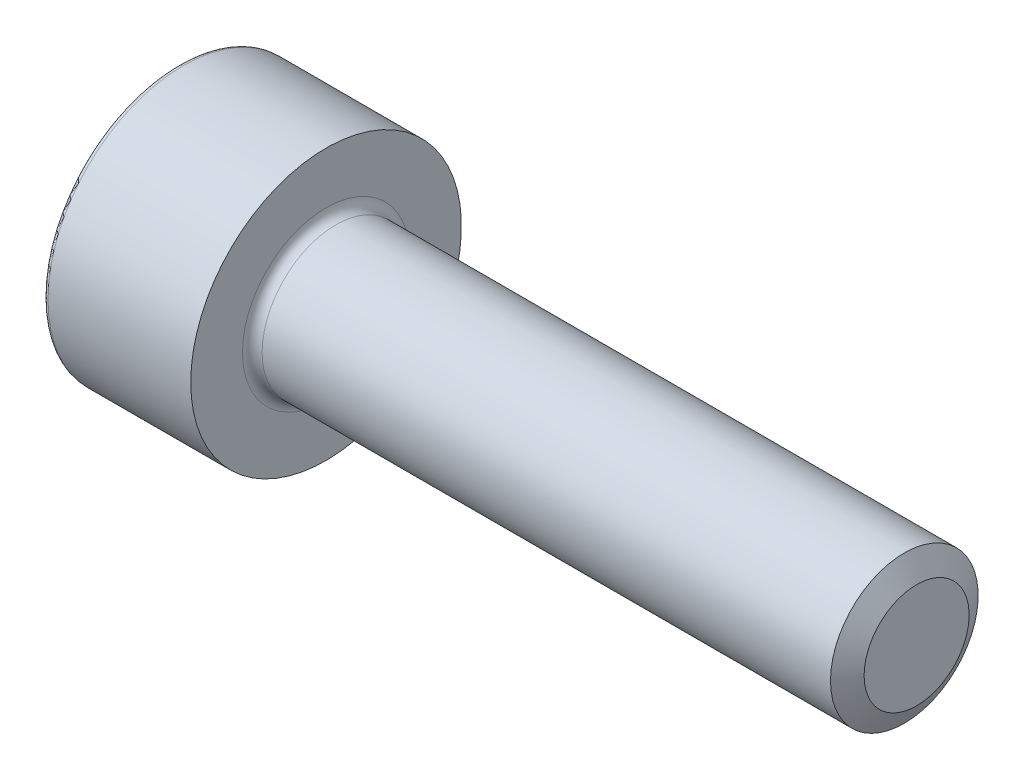
ISO-10303-21;
HEADER;
FILE_DESCRIPTION(('STEP AP214'),'2;1');
FILE_NAME('part.step','',(''),(''),'','','');
FILE_SCHEMA(('AUTOMOTIVE_DESIGN { 1 0 10303 214 1 1 1 1 }'));
ENDSEC;
DATA;
#1=APPLICATION_CONTEXT('core data for automotive mechanical design processes');
#2=APPLICATION_PROTOCOL_DEFINITION('international standard','automotive_design',2000,#1);
#3=PRODUCT_CONTEXT('',#1,'mechanical');
#4=PRODUCT('Part','Part','',(#3));
#5=PRODUCT_RELATED_PRODUCT_CATEGORY('part','',(#4));
#6=PRODUCT_DEFINITION_FORMATION('','',#4);
#7=PRODUCT_DEFINITION_CONTEXT('part definition',#1,'design');
#8=PRODUCT_DEFINITION('design','',#6,#7);
#9=PRODUCT_DEFINITION_SHAPE('','',#8);
#10=(LENGTH_UNIT() NAMED_UNIT(*) SI_UNIT(.MILLI.,.METRE.));
#11=(NAMED_UNIT(*) PLANE_ANGLE_UNIT() SI_UNIT($,.RADIAN.));
#12=(NAMED_UNIT(*) SI_UNIT($,.STERADIAN.) SOLID_ANGLE_UNIT());
#13=UNCERTAINTY_MEASURE_WITH_UNIT(LENGTH_MEASURE(1.E-05),#10,'distance_accuracy_value','');
#14=(GEOMETRIC_REPRESENTATION_CONTEXT(3) GLOBAL_UNCERTAINTY_ASSIGNED_CONTEXT((#13)) GLOBAL_UNIT_ASSIGNED_CONTEXT((#10,
#11,#12)) REPRESENTATION_CONTEXT('',''));
#15=CARTESIAN_POINT('',(0.,0.,0.));
#16=DIRECTION('',(0.,0.,1.));
#17=DIRECTION('',(1.,0.,0.));
#18=AXIS2_PLACEMENT_3D('',#15,#16,#17);
#19=CARTESIAN_POINT('',(0.,0.,0.));
#20=DIRECTION('',(-1.,0.,0.));
#21=DIRECTION('',(0.,0.,1.));
#22=AXIS2_PLACEMENT_3D('',#19,#20,#21);
#23=CYLINDRICAL_SURFACE('',#22,1.5);
#24=CARTESIAN_POINT('',(3.2,0.,0.));
#25=DIRECTION('',(-1.,0.,0.));
#26=DIRECTION('',(0.,0.,1.));
#27=AXIS2_PLACEMENT_3D('',#24,#25,#26);
#28=CIRCLE('',#27,1.5);
#29=CARTESIAN_POINT('',(3.2,0.,1.5));
#30=VERTEX_POINT('',#29);
#31=EDGE_CURVE('E142',#30,#30,#28,.T.);
#32=ORIENTED_EDGE('',*,*,#31,.F.);
#33=EDGE_LOOP('',(#32));
#34=FACE_BOUND('',#33,.T.);
#35=CARTESIAN_POINT('',(14.7500073334409,0.,0.));
#36=DIRECTION('',(-1.,0.,0.));
#37=DIRECTION('',(0.,0.,1.));
#38=AXIS2_PLACEMENT_3D('',#35,#36,#37);
#39=CIRCLE('',#38,1.5);
#40=CARTESIAN_POINT('',(14.7500073334409,0.,1.5));
#41=VERTEX_POINT('',#40);
#42=EDGE_CURVE('E279',#41,#41,#39,.T.);
#43=ORIENTED_EDGE('',*,*,#42,.T.);
#44=EDGE_LOOP('',(#43));
#45=FACE_BOUND('',#44,.T.);
#46=ADVANCED_FACE('F39',(#34,#45),#23,.T.);
#47=CARTESIAN_POINT('',(0.,0.,0.));
#48=DIRECTION('',(1.,0.,0.));
#49=DIRECTION('',(0.,0.,-1.));
#50=AXIS2_PLACEMENT_3D('',#47,#48,#49);
#51=PLANE('',#50);
#52=CARTESIAN_POINT('',(0.,0.,0.));
#53=DIRECTION('',(1.,0.,0.));
#54=DIRECTION('',(0.,0.,-1.));
#55=AXIS2_PLACEMENT_3D('',#52,#53,#54);
#56=CIRCLE('',#55,2.65);
#57=CARTESIAN_POINT('',(0.,0.,-2.65));
#58=VERTEX_POINT('',#57);
#59=EDGE_CURVE('E47',#58,#58,#56,.F.);
#60=ORIENTED_EDGE('',*,*,#59,.T.);
#61=EDGE_LOOP('',(#60));
#62=FACE_BOUND('',#61,.T.);
#63=DIRECTION('',(0.,0.866025403784439,-0.5));
#64=VECTOR('',#63,1.);
#65=CARTESIAN_POINT('',(0.,0.,1.435));
#66=LINE('',#65,#64);
#67=CARTESIAN_POINT('',(0.,0.,1.435));
#68=VERTEX_POINT('',#67);
#69=CARTESIAN_POINT('',(0.,1.24274645443067,0.717499999999999));
#70=VERTEX_POINT('',#69);
#71=EDGE_CURVE('E128',#68,#70,#66,.T.);
#72=ORIENTED_EDGE('',*,*,#71,.F.);
#73=DIRECTION('',(0.,0.866025403784439,0.5));
#74=VECTOR('',#73,1.);
#75=CARTESIAN_POINT('',(0.,-1.24274645443067,0.7175));
#76=LINE('',#75,#74);
#77=CARTESIAN_POINT('',(0.,-1.24274645443067,0.7175));
#78=VERTEX_POINT('',#77);
#79=EDGE_CURVE('E54',#78,#68,#76,.T.);
#80=ORIENTED_EDGE('',*,*,#79,.F.);
#81=DIRECTION('',(0.,0.,1.));
#82=VECTOR('',#81,1.);
#83=CARTESIAN_POINT('',(0.,-1.24274645443067,-0.7175));
#84=LINE('',#83,#82);
#85=CARTESIAN_POINT('',(0.,-1.24274645443067,-0.7175));
#86=VERTEX_POINT('',#85);
#87=EDGE_CURVE('E138',#86,#78,#84,.T.);
#88=ORIENTED_EDGE('',*,*,#87,.F.);
#89=DIRECTION('',(0.,-0.866025403784439,0.5));
#90=VECTOR('',#89,1.);
#91=CARTESIAN_POINT('',(0.,0.,-1.435));
#92=LINE('',#91,#90);
#93=CARTESIAN_POINT('',(0.,0.,-1.435));
#94=VERTEX_POINT('',#93);
#95=EDGE_CURVE('E136',#94,#86,#92,.T.);
#96=ORIENTED_EDGE('',*,*,#95,.F.);
#97=DIRECTION('',(0.,-0.866025403784439,-0.5));
#98=VECTOR('',#97,1.);
#99=CARTESIAN_POINT('',(0.,1.24274645443067,-0.7175));
#100=LINE('',#99,#98);
#101=CARTESIAN_POINT('',(0.,1.24274645443067,-0.7175));
#102=VERTEX_POINT('',#101);
#103=EDGE_CURVE('E102',#102,#94,#100,.T.);
#104=ORIENTED_EDGE('',*,*,#103,.F.);
#105=DIRECTION('',(0.,0.,-1.));
#106=VECTOR('',#105,1.);
#107=CARTESIAN_POINT('',(0.,1.24274645443067,0.717499999999999));
#108=LINE('',#107,#106);
#109=EDGE_CURVE('E132',#70,#102,#108,.T.);
#110=ORIENTED_EDGE('',*,*,#109,.F.);
#111=EDGE_LOOP('',(#72,#80,#88,#96,#104,#110));
#112=FACE_BOUND('',#111,.T.);
#113=ADVANCED_FACE('F159',(#62,#112),#51,.F.);
#114=CARTESIAN_POINT('',(0.,0.,0.));
#115=DIRECTION('',(-1.,0.,0.));
#116=DIRECTION('',(0.,0.,1.));
#117=AXIS2_PLACEMENT_3D('',#114,#115,#116);
#118=CYLINDRICAL_SURFACE('',#117,2.75);
#119=CARTESIAN_POINT('',(0.1,0.,0.));
#120=DIRECTION('',(1.,0.,0.));
#121=DIRECTION('',(0.,0.,-1.));
#122=AXIS2_PLACEMENT_3D('',#119,#120,#121);
#123=CIRCLE('',#122,2.75);
#124=CARTESIAN_POINT('',(0.1,0.,-2.75));
#125=VERTEX_POINT('',#124);
#126=EDGE_CURVE('E11',#125,#125,#123,.T.);
#127=ORIENTED_EDGE('',*,*,#126,.T.);
#128=EDGE_LOOP('',(#127));
#129=FACE_BOUND('',#128,.T.);
#130=CARTESIAN_POINT('',(3.,0.,0.));
#131=DIRECTION('',(-1.,0.,0.));
#132=DIRECTION('',(0.,0.,1.));
#133=AXIS2_PLACEMENT_3D('',#130,#131,#132);
#134=CIRCLE('',#133,2.75);
#135=CARTESIAN_POINT('',(3.,0.,2.75));
#136=VERTEX_POINT('',#135);
#137=EDGE_CURVE('E153',#136,#136,#134,.T.);
#138=ORIENTED_EDGE('',*,*,#137,.T.);
#139=EDGE_LOOP('',(#138));
#140=FACE_BOUND('',#139,.T.);
#141=ADVANCED_FACE('F178',(#129,#140),#118,.T.);
#142=CARTESIAN_POINT('',(3.,2.75,0.));
#143=DIRECTION('',(-1.,0.,0.));
#144=DIRECTION('',(0.,0.,1.));
#145=AXIS2_PLACEMENT_3D('',#142,#143,#144);
#146=PLANE('',#145);
#147=ORIENTED_EDGE('',*,*,#137,.F.);
#148=EDGE_LOOP('',(#147));
#149=FACE_BOUND('',#148,.T.);
#150=CARTESIAN_POINT('',(3.,0.,0.));
#151=DIRECTION('',(-1.,0.,0.));
#152=DIRECTION('',(0.,0.,1.));
#153=AXIS2_PLACEMENT_3D('',#150,#151,#152);
#154=CIRCLE('',#153,1.7);
#155=CARTESIAN_POINT('',(3.,0.,1.7));
#156=VERTEX_POINT('',#155);
#157=EDGE_CURVE('E150',#156,#156,#154,.T.);
#158=ORIENTED_EDGE('',*,*,#157,.T.);
#159=EDGE_LOOP('',(#158));
#160=FACE_BOUND('',#159,.T.);
#161=ADVANCED_FACE('F187',(#149,#160),#146,.F.);
#162=CARTESIAN_POINT('',(3.2,0.,0.));
#163=DIRECTION('',(-1.,0.,0.));
#164=DIRECTION('',(0.,0.,1.));
#165=AXIS2_PLACEMENT_3D('',#162,#163,#164);
#166=TOROIDAL_SURFACE('',#165,1.7,0.2);
#167=ORIENTED_EDGE('',*,*,#157,.F.);
#168=EDGE_LOOP('',(#167));
#169=FACE_BOUND('',#168,.T.);
#170=ORIENTED_EDGE('',*,*,#31,.T.);
#171=EDGE_LOOP('',(#170));
#172=FACE_BOUND('',#171,.T.);
#173=ADVANCED_FACE('F183',(#169,#172),#166,.F.);
#174=CARTESIAN_POINT('',(1.3,-1.24274645443067,0.7175));
#175=DIRECTION('',(0.,-0.5,0.866025403784439));
#176=DIRECTION('',(0.,-0.866025403784439,-0.5));
#177=AXIS2_PLACEMENT_3D('',#174,#175,#176);
#178=PLANE('',#177);
#179=ORIENTED_EDGE('',*,*,#79,.T.);
#180=DIRECTION('',(-1.,0.,0.));
#181=VECTOR('',#180,1.);
#182=CARTESIAN_POINT('',(1.3,0.,1.435));
#183=LINE('',#182,#181);
#184=CARTESIAN_POINT('',(1.3,0.,1.435));
#185=VERTEX_POINT('',#184);
#186=EDGE_CURVE('E84',#185,#68,#183,.T.);
#187=ORIENTED_EDGE('',*,*,#186,.F.);
#188=DIRECTION('',(0.,0.866025403784439,0.5));
#189=VECTOR('',#188,1.);
#190=CARTESIAN_POINT('',(1.3,-1.24274645443067,0.7175));
#191=LINE('',#190,#189);
#192=CARTESIAN_POINT('',(1.3,-1.24274645443067,0.7175));
#193=VERTEX_POINT('',#192);
#194=EDGE_CURVE('E140',#193,#185,#191,.T.);
#195=ORIENTED_EDGE('',*,*,#194,.F.);
#196=DIRECTION('',(-1.,0.,0.));
#197=VECTOR('',#196,1.);
#198=CARTESIAN_POINT('',(1.3,-1.24274645443067,0.7175));
#199=LINE('',#198,#197);
#200=EDGE_CURVE('E62',#193,#78,#199,.T.);
#201=ORIENTED_EDGE('',*,*,#200,.T.);
#202=EDGE_LOOP('',(#179,#187,#195,#201));
#203=FACE_BOUND('',#202,.T.);
#204=ADVANCED_FACE('F186',(#203),#178,.F.);
#205=CARTESIAN_POINT('',(1.3,-1.24274645443067,-0.7175));
#206=DIRECTION('',(0.,-1.,0.));
#207=DIRECTION('',(0.,0.,-1.));
#208=AXIS2_PLACEMENT_3D('',#205,#206,#207);
#209=PLANE('',#208);
#210=ORIENTED_EDGE('',*,*,#87,.T.);
#211=ORIENTED_EDGE('',*,*,#200,.F.);
#212=DIRECTION('',(0.,0.,1.));
#213=VECTOR('',#212,1.);
#214=CARTESIAN_POINT('',(1.3,-1.24274645443067,-0.7175));
#215=LINE('',#214,#213);
#216=CARTESIAN_POINT('',(1.3,-1.24274645443067,-0.7175));
#217=VERTEX_POINT('',#216);
#218=EDGE_CURVE('E114',#217,#193,#215,.T.);
#219=ORIENTED_EDGE('',*,*,#218,.F.);
#220=DIRECTION('',(-1.,0.,0.));
#221=VECTOR('',#220,1.);
#222=CARTESIAN_POINT('',(1.3,-1.24274645443067,-0.7175));
#223=LINE('',#222,#221);
#224=EDGE_CURVE('E106',#217,#86,#223,.T.);
#225=ORIENTED_EDGE('',*,*,#224,.T.);
#226=EDGE_LOOP('',(#210,#211,#219,#225));
#227=FACE_BOUND('',#226,.T.);
#228=ADVANCED_FACE('F217',(#227),#209,.F.);
#229=CARTESIAN_POINT('',(1.3,0.,-1.435));
#230=DIRECTION('',(0.,-0.5,-0.866025403784439));
#231=DIRECTION('',(0.,0.866025403784439,-0.5));
#232=AXIS2_PLACEMENT_3D('',#229,#230,#231);
#233=PLANE('',#232);
#234=ORIENTED_EDGE('',*,*,#95,.T.);
#235=ORIENTED_EDGE('',*,*,#224,.F.);
#236=DIRECTION('',(0.,-0.866025403784439,0.5));
#237=VECTOR('',#236,1.);
#238=CARTESIAN_POINT('',(1.3,0.,-1.435));
#239=LINE('',#238,#237);
#240=CARTESIAN_POINT('',(1.3,0.,-1.435));
#241=VERTEX_POINT('',#240);
#242=EDGE_CURVE('E110',#241,#217,#239,.T.);
#243=ORIENTED_EDGE('',*,*,#242,.F.);
#244=DIRECTION('',(-1.,0.,0.));
#245=VECTOR('',#244,1.);
#246=CARTESIAN_POINT('',(1.3,0.,-1.435));
#247=LINE('',#246,#245);
#248=EDGE_CURVE('E95',#241,#94,#247,.T.);
#249=ORIENTED_EDGE('',*,*,#248,.T.);
#250=EDGE_LOOP('',(#234,#235,#243,#249));
#251=FACE_BOUND('',#250,.T.);
#252=ADVANCED_FACE('F111',(#251),#233,.F.);
#253=CARTESIAN_POINT('',(1.3,1.24274645443067,-0.7175));
#254=DIRECTION('',(0.,0.5,-0.866025403784439));
#255=DIRECTION('',(0.,0.866025403784439,0.5));
#256=AXIS2_PLACEMENT_3D('',#253,#254,#255);
#257=PLANE('',#256);
#258=ORIENTED_EDGE('',*,*,#103,.T.);
#259=ORIENTED_EDGE('',*,*,#248,.F.);
#260=DIRECTION('',(0.,-0.866025403784439,-0.5));
#261=VECTOR('',#260,1.);
#262=CARTESIAN_POINT('',(1.3,1.24274645443067,-0.7175));
#263=LINE('',#262,#261);
#264=CARTESIAN_POINT('',(1.3,1.24274645443067,-0.7175));
#265=VERTEX_POINT('',#264);
#266=EDGE_CURVE('E99',#265,#241,#263,.T.);
#267=ORIENTED_EDGE('',*,*,#266,.F.);
#268=DIRECTION('',(-1.,0.,0.));
#269=VECTOR('',#268,1.);
#270=CARTESIAN_POINT('',(1.3,1.24274645443067,-0.7175));
#271=LINE('',#270,#269);
#272=EDGE_CURVE('E107',#265,#102,#271,.T.);
#273=ORIENTED_EDGE('',*,*,#272,.T.);
#274=EDGE_LOOP('',(#258,#259,#267,#273));
#275=FACE_BOUND('',#274,.T.);
#276=ADVANCED_FACE('F97',(#275),#257,.F.);
#277=CARTESIAN_POINT('',(1.3,1.24274645443067,0.717499999999999));
#278=DIRECTION('',(0.,1.,0.));
#279=DIRECTION('',(0.,0.,1.));
#280=AXIS2_PLACEMENT_3D('',#277,#278,#279);
#281=PLANE('',#280);
#282=ORIENTED_EDGE('',*,*,#109,.T.);
#283=ORIENTED_EDGE('',*,*,#272,.F.);
#284=DIRECTION('',(0.,0.,-1.));
#285=VECTOR('',#284,1.);
#286=CARTESIAN_POINT('',(1.3,1.24274645443067,0.717499999999999));
#287=LINE('',#286,#285);
#288=CARTESIAN_POINT('',(1.3,1.24274645443067,0.717499999999999));
#289=VERTEX_POINT('',#288);
#290=EDGE_CURVE('E120',#289,#265,#287,.T.);
#291=ORIENTED_EDGE('',*,*,#290,.F.);
#292=DIRECTION('',(-1.,0.,0.));
#293=VECTOR('',#292,1.);
#294=CARTESIAN_POINT('',(1.3,1.24274645443067,0.717499999999999));
#295=LINE('',#294,#293);
#296=EDGE_CURVE('E145',#289,#70,#295,.T.);
#297=ORIENTED_EDGE('',*,*,#296,.T.);
#298=EDGE_LOOP('',(#282,#283,#291,#297));
#299=FACE_BOUND('',#298,.T.);
#300=ADVANCED_FACE('F235',(#299),#281,.F.);
#301=CARTESIAN_POINT('',(1.3,0.,1.435));
#302=DIRECTION('',(0.,0.5,0.866025403784439));
#303=DIRECTION('',(0.,-0.866025403784439,0.5));
#304=AXIS2_PLACEMENT_3D('',#301,#302,#303);
#305=PLANE('',#304);
#306=ORIENTED_EDGE('',*,*,#71,.T.);
#307=ORIENTED_EDGE('',*,*,#296,.F.);
#308=DIRECTION('',(0.,0.866025403784439,-0.5));
#309=VECTOR('',#308,1.);
#310=CARTESIAN_POINT('',(1.3,0.,1.435));
#311=LINE('',#310,#309);
#312=EDGE_CURVE('E122',#185,#289,#311,.T.);
#313=ORIENTED_EDGE('',*,*,#312,.F.);
#314=ORIENTED_EDGE('',*,*,#186,.T.);
#315=EDGE_LOOP('',(#306,#307,#313,#314));
#316=FACE_BOUND('',#315,.T.);
#317=ADVANCED_FACE('F242',(#316),#305,.F.);
#318=CARTESIAN_POINT('',(1.3,-1.24274645443067,0.7175));
#319=DIRECTION('',(1.,0.,0.));
#320=DIRECTION('',(0.,0.,-1.));
#321=AXIS2_PLACEMENT_3D('',#318,#319,#320);
#322=PLANE('',#321);
#323=ORIENTED_EDGE('',*,*,#194,.T.);
#324=ORIENTED_EDGE('',*,*,#312,.T.);
#325=ORIENTED_EDGE('',*,*,#290,.T.);
#326=ORIENTED_EDGE('',*,*,#266,.T.);
#327=ORIENTED_EDGE('',*,*,#242,.T.);
#328=ORIENTED_EDGE('',*,*,#218,.T.);
#329=EDGE_LOOP('',(#323,#324,#325,#326,#327,#328));
#330=FACE_BOUND('',#329,.T.);
#331=ADVANCED_FACE('F117',(#330),#322,.F.);
#332=CARTESIAN_POINT('',(14.7500073334409,0.,0.));
#333=DIRECTION('',(-1.,0.,0.));
#334=DIRECTION('',(0.,0.,1.));
#335=AXIS2_PLACEMENT_3D('',#332,#333,#334);
#336=CONICAL_SURFACE('',#335,1.5,1.0471975511966);
#337=CARTESIAN_POINT('',(15.,0.,0.));
#338=DIRECTION('',(-1.,0.,0.));
#339=DIRECTION('',(0.,0.,1.));
#340=AXIS2_PLACEMENT_3D('',#337,#338,#339);
#341=CIRCLE('',#340,1.067);
#342=CARTESIAN_POINT('',(15.,0.,1.067));
#343=VERTEX_POINT('',#342);
#344=EDGE_CURVE('E129',#343,#343,#341,.T.);
#345=ORIENTED_EDGE('',*,*,#344,.T.);
#346=EDGE_LOOP('',(#345));
#347=FACE_BOUND('',#346,.T.);
#348=ORIENTED_EDGE('',*,*,#42,.F.);
#349=EDGE_LOOP('',(#348));
#350=FACE_BOUND('',#349,.T.);
#351=ADVANCED_FACE('F168',(#347,#350),#336,.T.);
#352=CARTESIAN_POINT('',(15.,1.5,0.));
#353=DIRECTION('',(-1.,0.,0.));
#354=DIRECTION('',(0.,0.,1.));
#355=AXIS2_PLACEMENT_3D('',#352,#353,#354);
#356=PLANE('',#355);
#357=ORIENTED_EDGE('',*,*,#344,.F.);
#358=EDGE_LOOP('',(#357));
#359=FACE_BOUND('',#358,.T.);
#360=ADVANCED_FACE('F163',(#359),#356,.F.);
#361=CARTESIAN_POINT('',(0.1,0.,0.));
#362=DIRECTION('',(1.,0.,0.));
#363=DIRECTION('',(0.,0.,-1.));
#364=AXIS2_PLACEMENT_3D('',#361,#362,#363);
#365=TOROIDAL_SURFACE('',#364,2.65,0.1);
#366=ORIENTED_EDGE('',*,*,#126,.F.);
#367=EDGE_LOOP('',(#366));
#368=FACE_BOUND('',#367,.T.);
#369=ORIENTED_EDGE('',*,*,#59,.F.);
#370=EDGE_LOOP('',(#369));
#371=FACE_BOUND('',#370,.T.);
#372=ADVANCED_FACE('F41',(#368,#371),#365,.T.);
#373=CLOSED_SHELL('',(#46,#113,#141,#161,#173,#204,#228,#252,#276,#300,#317,#331,#351,#360,#372));
#374=MANIFOLD_SOLID_BREP('B2',#373);
#375=ADVANCED_BREP_SHAPE_REPRESENTATION('',(#18,#374),#14);
#376=SHAPE_DEFINITION_REPRESENTATION(#9,#375);
ENDSEC;
END-ISO-10303-21;
